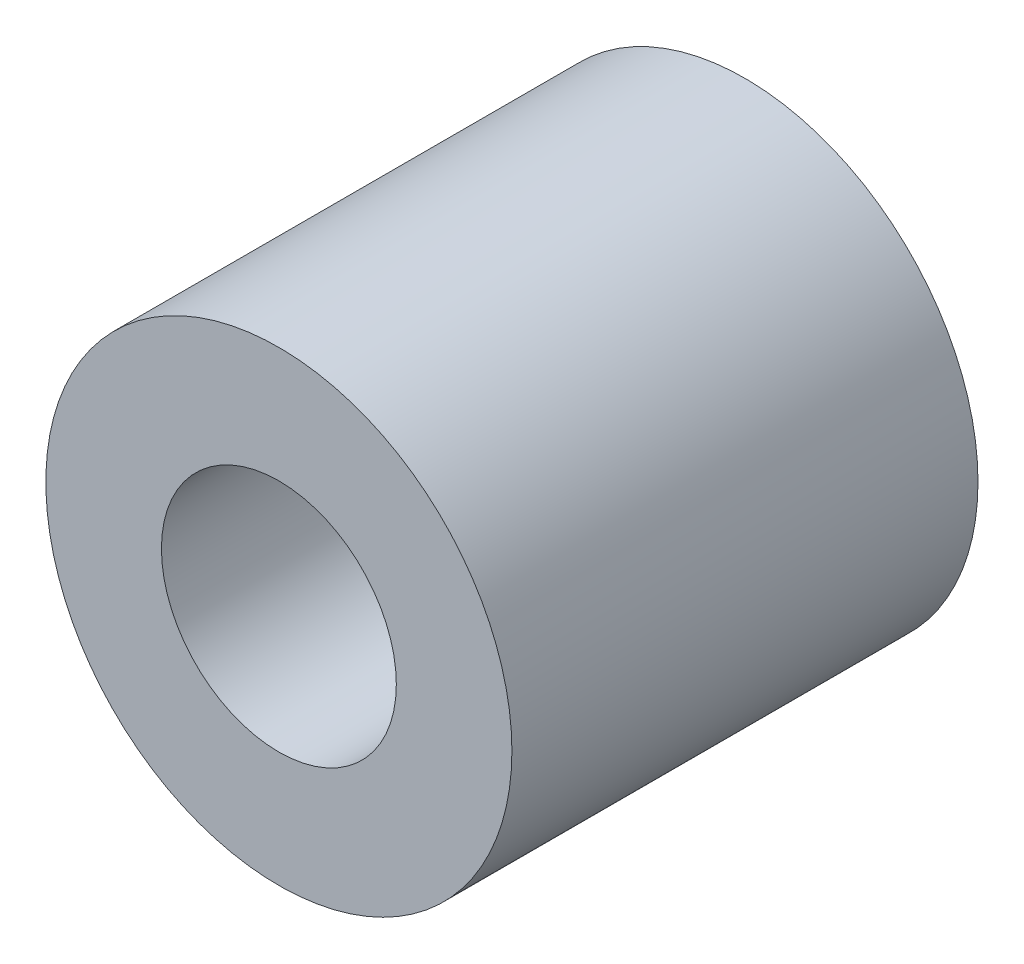
ISO-10303-21;
HEADER;
FILE_DESCRIPTION(('STEP AP214'),'2;1');
FILE_NAME('part.step','',(''),(''),'','','');
FILE_SCHEMA(('AUTOMOTIVE_DESIGN { 1 0 10303 214 1 1 1 1 }'));
ENDSEC;
DATA;
#1=APPLICATION_CONTEXT('core data for automotive mechanical design processes');
#2=APPLICATION_PROTOCOL_DEFINITION('international standard','automotive_design',2000,#1);
#3=PRODUCT_CONTEXT('',#1,'mechanical');
#4=PRODUCT('Part','Part','',(#3));
#5=PRODUCT_RELATED_PRODUCT_CATEGORY('part','',(#4));
#6=PRODUCT_DEFINITION_FORMATION('','',#4);
#7=PRODUCT_DEFINITION_CONTEXT('part definition',#1,'design');
#8=PRODUCT_DEFINITION('design','',#6,#7);
#9=PRODUCT_DEFINITION_SHAPE('','',#8);
#10=(LENGTH_UNIT() NAMED_UNIT(*) SI_UNIT(.MILLI.,.METRE.));
#11=(NAMED_UNIT(*) PLANE_ANGLE_UNIT() SI_UNIT($,.RADIAN.));
#12=(NAMED_UNIT(*) SI_UNIT($,.STERADIAN.) SOLID_ANGLE_UNIT());
#13=UNCERTAINTY_MEASURE_WITH_UNIT(LENGTH_MEASURE(1.E-05),#10,'distance_accuracy_value','');
#14=(GEOMETRIC_REPRESENTATION_CONTEXT(3) GLOBAL_UNCERTAINTY_ASSIGNED_CONTEXT((#13)) GLOBAL_UNIT_ASSIGNED_CONTEXT((#10,
#11,#12)) REPRESENTATION_CONTEXT('',''));
#15=CARTESIAN_POINT('',(0.,0.,0.));
#16=DIRECTION('',(0.,0.,1.));
#17=DIRECTION('',(1.,0.,0.));
#18=AXIS2_PLACEMENT_3D('',#15,#16,#17);
#19=CARTESIAN_POINT('',(0.,0.,6.35));
#20=DIRECTION('',(0.,0.,1.));
#21=DIRECTION('',(1.,0.,0.));
#22=AXIS2_PLACEMENT_3D('',#19,#20,#21);
#23=PLANE('',#22);
#24=CARTESIAN_POINT('',(0.,0.,6.35));
#25=DIRECTION('',(0.,0.,1.));
#26=DIRECTION('',(1.,0.,0.));
#27=AXIS2_PLACEMENT_3D('',#24,#25,#26);
#28=CIRCLE('',#27,6.35);
#29=CARTESIAN_POINT('',(6.35,0.,6.35));
#30=VERTEX_POINT('',#29);
#31=EDGE_CURVE('E10',#30,#30,#28,.T.);
#32=ORIENTED_EDGE('',*,*,#31,.T.);
#33=EDGE_LOOP('',(#32));
#34=FACE_BOUND('',#33,.T.);
#35=CARTESIAN_POINT('',(0.,0.,6.35));
#36=DIRECTION('',(0.,0.,1.));
#37=DIRECTION('',(1.,0.,0.));
#38=AXIS2_PLACEMENT_3D('',#35,#36,#37);
#39=CIRCLE('',#38,3.2004);
#40=CARTESIAN_POINT('',(3.2004,0.,6.35));
#41=VERTEX_POINT('',#40);
#42=EDGE_CURVE('E39',#41,#41,#39,.T.);
#43=ORIENTED_EDGE('',*,*,#42,.F.);
#44=EDGE_LOOP('',(#43));
#45=FACE_BOUND('',#44,.T.);
#46=ADVANCED_FACE('F32',(#34,#45),#23,.T.);
#47=CARTESIAN_POINT('',(0.,0.,6.35));
#48=DIRECTION('',(0.,0.,-1.));
#49=DIRECTION('',(-1.,0.,0.));
#50=AXIS2_PLACEMENT_3D('',#47,#48,#49);
#51=CYLINDRICAL_SURFACE('',#50,6.35);
#52=ORIENTED_EDGE('',*,*,#31,.F.);
#53=EDGE_LOOP('',(#52));
#54=FACE_BOUND('',#53,.T.);
#55=CARTESIAN_POINT('',(0.,0.,-6.35));
#56=DIRECTION('',(0.,0.,1.));
#57=DIRECTION('',(1.,0.,0.));
#58=AXIS2_PLACEMENT_3D('',#55,#56,#57);
#59=CIRCLE('',#58,6.35);
#60=CARTESIAN_POINT('',(6.35,0.,-6.35));
#61=VERTEX_POINT('',#60);
#62=EDGE_CURVE('E43',#61,#61,#59,.T.);
#63=ORIENTED_EDGE('',*,*,#62,.T.);
#64=EDGE_LOOP('',(#63));
#65=FACE_BOUND('',#64,.T.);
#66=ADVANCED_FACE('F34',(#54,#65),#51,.T.);
#67=CARTESIAN_POINT('',(0.,0.,6.35));
#68=DIRECTION('',(0.,0.,-1.));
#69=DIRECTION('',(-1.,0.,0.));
#70=AXIS2_PLACEMENT_3D('',#67,#68,#69);
#71=CYLINDRICAL_SURFACE('',#70,3.2004);
#72=ORIENTED_EDGE('',*,*,#42,.T.);
#73=EDGE_LOOP('',(#72));
#74=FACE_BOUND('',#73,.T.);
#75=CARTESIAN_POINT('',(0.,0.,-6.35));
#76=DIRECTION('',(0.,0.,1.));
#77=DIRECTION('',(1.,0.,0.));
#78=AXIS2_PLACEMENT_3D('',#75,#76,#77);
#79=CIRCLE('',#78,3.2004);
#80=CARTESIAN_POINT('',(3.2004,0.,-6.35));
#81=VERTEX_POINT('',#80);
#82=EDGE_CURVE('E47',#81,#81,#79,.T.);
#83=ORIENTED_EDGE('',*,*,#82,.F.);
#84=EDGE_LOOP('',(#83));
#85=FACE_BOUND('',#84,.T.);
#86=ADVANCED_FACE('F56',(#74,#85),#71,.F.);
#87=CARTESIAN_POINT('',(0.,0.,-6.35));
#88=DIRECTION('',(0.,0.,1.));
#89=DIRECTION('',(1.,0.,0.));
#90=AXIS2_PLACEMENT_3D('',#87,#88,#89);
#91=PLANE('',#90);
#92=ORIENTED_EDGE('',*,*,#82,.T.);
#93=EDGE_LOOP('',(#92));
#94=FACE_BOUND('',#93,.T.);
#95=ORIENTED_EDGE('',*,*,#62,.F.);
#96=EDGE_LOOP('',(#95));
#97=FACE_BOUND('',#96,.T.);
#98=ADVANCED_FACE('F53',(#94,#97),#91,.F.);
#99=CLOSED_SHELL('',(#46,#66,#86,#98));
#100=MANIFOLD_SOLID_BREP('B2',#99);
#101=ADVANCED_BREP_SHAPE_REPRESENTATION('',(#18,#100),#14);
#102=SHAPE_DEFINITION_REPRESENTATION(#9,#101);
ENDSEC;
END-ISO-10303-21;
